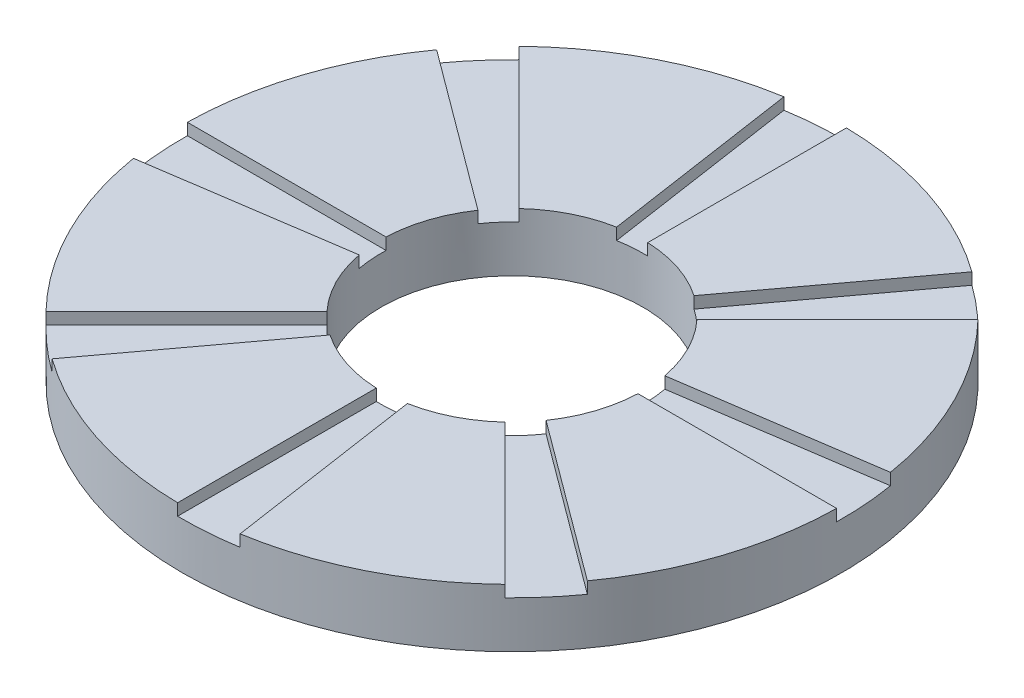
ISO-10303-21;
HEADER;
FILE_DESCRIPTION(('STEP AP214'),'2;1');
FILE_NAME('part.step','',(''),(''),'','','');
FILE_SCHEMA(('AUTOMOTIVE_DESIGN { 1 0 10303 214 1 1 1 1 }'));
ENDSEC;
DATA;
#1=APPLICATION_CONTEXT('core data for automotive mechanical design processes');
#2=APPLICATION_PROTOCOL_DEFINITION('international standard','automotive_design',2000,#1);
#3=PRODUCT_CONTEXT('',#1,'mechanical');
#4=PRODUCT('Part','Part','',(#3));
#5=PRODUCT_RELATED_PRODUCT_CATEGORY('part','',(#4));
#6=PRODUCT_DEFINITION_FORMATION('','',#4);
#7=PRODUCT_DEFINITION_CONTEXT('part definition',#1,'design');
#8=PRODUCT_DEFINITION('design','',#6,#7);
#9=PRODUCT_DEFINITION_SHAPE('','',#8);
#10=(LENGTH_UNIT() NAMED_UNIT(*) SI_UNIT(.MILLI.,.METRE.));
#11=(NAMED_UNIT(*) PLANE_ANGLE_UNIT() SI_UNIT($,.RADIAN.));
#12=(NAMED_UNIT(*) SI_UNIT($,.STERADIAN.) SOLID_ANGLE_UNIT());
#13=UNCERTAINTY_MEASURE_WITH_UNIT(LENGTH_MEASURE(1.E-05),#10,'distance_accuracy_value','');
#14=(GEOMETRIC_REPRESENTATION_CONTEXT(3) GLOBAL_UNCERTAINTY_ASSIGNED_CONTEXT((#13)) GLOBAL_UNIT_ASSIGNED_CONTEXT((#10,
#11,#12)) REPRESENTATION_CONTEXT('',''));
#15=CARTESIAN_POINT('',(0.,0.,0.));
#16=DIRECTION('',(0.,0.,1.));
#17=DIRECTION('',(1.,0.,0.));
#18=AXIS2_PLACEMENT_3D('',#15,#16,#17);
#19=CARTESIAN_POINT('',(0.,10.,0.));
#20=DIRECTION('',(0.,1.,0.));
#21=DIRECTION('',(0.,0.,1.));
#22=AXIS2_PLACEMENT_3D('',#19,#20,#21);
#23=PLANE('',#22);
#24=CARTESIAN_POINT('',(0.,10.,0.));
#25=DIRECTION('',(0.,1.,0.));
#26=DIRECTION('',(0.,0.,1.));
#27=AXIS2_PLACEMENT_3D('',#24,#25,#26);
#28=CIRCLE('',#27,22.4405334719767);
#29=CARTESIAN_POINT('',(-12.679308810646,10.,18.5152010680732));
#30=VERTEX_POINT('',#29);
#31=CARTESIAN_POINT('',(-0.83764015496411,10.,22.4248946815296));
#32=VERTEX_POINT('',#31);
#33=EDGE_CURVE('E572',#30,#32,#28,.T.);
#34=ORIENTED_EDGE('',*,*,#33,.F.);
#35=DIRECTION('',(-0.59542218485859,0.,0.803412983326896));
#36=VECTOR('',#35,1.);
#37=CARTESIAN_POINT('',(0.672970975854119,10.,0.498749531194018));
#38=LINE('',#37,#36);
#39=CARTESIAN_POINT('',(-32.9564578938166,10.,45.8754930634804));
#40=VERTEX_POINT('',#39);
#41=EDGE_CURVE('E343',#30,#40,#38,.T.);
#42=ORIENTED_EDGE('',*,*,#41,.T.);
#43=CARTESIAN_POINT('',(0.,10.,0.));
#44=DIRECTION('',(0.,1.,0.));
#45=DIRECTION('',(0.,0.,1.));
#46=AXIS2_PLACEMENT_3D('',#43,#44,#45);
#47=CIRCLE('',#46,56.4861839809023);
#48=CARTESIAN_POINT('',(-0.83764015496411,10.,56.4799729080595));
#49=VERTEX_POINT('',#48);
#50=EDGE_CURVE('E623',#40,#49,#47,.T.);
#51=ORIENTED_EDGE('',*,*,#50,.T.);
#52=DIRECTION('',(0.,0.,1.));
#53=VECTOR('',#52,1.);
#54=CARTESIAN_POINT('',(-0.83764015496411,10.,0.));
#55=LINE('',#54,#53);
#56=EDGE_CURVE('E325',#32,#49,#55,.T.);
#57=ORIENTED_EDGE('',*,*,#56,.F.);
#58=EDGE_LOOP('',(#34,#42,#51,#57));
#59=FACE_BOUND('',#58,.T.);
#60=ADVANCED_FACE('F41',(#59),#23,.T.);
#61=CARTESIAN_POINT('',(4.12659898950101,10.,22.0578494710331));
#62=VERTEX_POINT('',#61);
#63=CARTESIAN_POINT('',(15.2644940629344,10.,16.4490961304731));
#64=VERTEX_POINT('',#63);
#65=EDGE_CURVE('E577',#62,#64,#28,.T.);
#66=ORIENTED_EDGE('',*,*,#65,.F.);
#67=DIRECTION('',(0.147071704021353,0.,0.989125833186181));
#68=VECTOR('',#67,1.);
#69=CARTESIAN_POINT('',(0.828531516189076,10.,-0.123193164947281));
#70=LINE('',#69,#68);
#71=CARTESIAN_POINT('',(9.13513737485721,10.,55.74260709607));
#72=VERTEX_POINT('',#71);
#73=EDGE_CURVE('E319',#62,#72,#70,.T.);
#74=ORIENTED_EDGE('',*,*,#73,.T.);
#75=CARTESIAN_POINT('',(39.3450708107519,10.,40.5296728782908));
#76=VERTEX_POINT('',#75);
#77=EDGE_CURVE('E617',#72,#76,#47,.T.);
#78=ORIENTED_EDGE('',*,*,#77,.T.);
#79=DIRECTION('',(0.707106781186544,0.,0.707106781186551));
#80=VECTOR('',#79,1.);
#81=CARTESIAN_POINT('',(-0.592301033769276,10.,0.592301033769269));
#82=LINE('',#81,#80);
#83=EDGE_CURVE('E335',#64,#76,#82,.T.);
#84=ORIENTED_EDGE('',*,*,#83,.F.);
#85=EDGE_LOOP('',(#66,#74,#78,#84));
#86=FACE_BOUND('',#85,.T.);
#87=ADVANCED_FACE('F675',(#86),#23,.T.);
#88=CARTESIAN_POINT('',(18.5152010680732,10.,12.679308810646));
#89=VERTEX_POINT('',#88);
#90=CARTESIAN_POINT('',(22.4248946815296,10.,0.837640154964188));
#91=VERTEX_POINT('',#90);
#92=EDGE_CURVE('E582',#89,#91,#28,.T.);
#93=ORIENTED_EDGE('',*,*,#92,.F.);
#94=DIRECTION('',(0.803412983326898,0.,0.595422184858587));
#95=VECTOR('',#94,1.);
#96=CARTESIAN_POINT('',(0.498749531194016,10.,-0.672970975854121));
#97=LINE('',#96,#95);
#98=CARTESIAN_POINT('',(45.8754930634805,10.,32.9564578938165));
#99=VERTEX_POINT('',#98);
#100=EDGE_CURVE('E389',#89,#99,#97,.T.);
#101=ORIENTED_EDGE('',*,*,#100,.T.);
#102=CARTESIAN_POINT('',(56.4799729080595,10.,0.837640154964307));
#103=VERTEX_POINT('',#102);
#104=EDGE_CURVE('E611',#99,#103,#47,.T.);
#105=ORIENTED_EDGE('',*,*,#104,.T.);
#106=DIRECTION('',(1.,0.,0.));
#107=VECTOR('',#106,1.);
#108=CARTESIAN_POINT('',(0.,10.,0.83764015496411));
#109=LINE('',#108,#107);
#110=EDGE_CURVE('E371',#91,#103,#109,.T.);
#111=ORIENTED_EDGE('',*,*,#110,.F.);
#112=EDGE_LOOP('',(#93,#101,#105,#111));
#113=FACE_BOUND('',#112,.T.);
#114=ADVANCED_FACE('F680',(#113),#23,.T.);
#115=CARTESIAN_POINT('',(22.0578494710331,10.,-4.12659898950093));
#116=VERTEX_POINT('',#115);
#117=CARTESIAN_POINT('',(16.4490961304731,10.,-15.2644940629345));
#118=VERTEX_POINT('',#117);
#119=EDGE_CURVE('E587',#116,#118,#28,.T.);
#120=ORIENTED_EDGE('',*,*,#119,.F.);
#121=DIRECTION('',(0.989125833186181,0.,-0.147071704021349));
#122=VECTOR('',#121,1.);
#123=CARTESIAN_POINT('',(-0.123193164947278,10.,-0.828531516189077));
#124=LINE('',#123,#122);
#125=CARTESIAN_POINT('',(55.74260709607,10.,-9.13513737485702));
#126=VERTEX_POINT('',#125);
#127=EDGE_CURVE('E363',#116,#126,#124,.T.);
#128=ORIENTED_EDGE('',*,*,#127,.T.);
#129=CARTESIAN_POINT('',(40.5296728782907,10.,-39.345070810752));
#130=VERTEX_POINT('',#129);
#131=EDGE_CURVE('E608',#126,#130,#47,.T.);
#132=ORIENTED_EDGE('',*,*,#131,.T.);
#133=DIRECTION('',(0.707106781186549,0.,-0.707106781186546));
#134=VECTOR('',#133,1.);
#135=CARTESIAN_POINT('',(0.592301033769271,10.,0.592301033769273));
#136=LINE('',#135,#134);
#137=EDGE_CURVE('E381',#118,#130,#136,.T.);
#138=ORIENTED_EDGE('',*,*,#137,.F.);
#139=EDGE_LOOP('',(#120,#128,#132,#138));
#140=FACE_BOUND('',#139,.T.);
#141=ADVANCED_FACE('F699',(#140),#23,.T.);
#142=DIRECTION('',(-0.707106781186554,0.,0.707106781186541));
#143=VECTOR('',#142,1.);
#144=CARTESIAN_POINT('',(-0.592301033769267,10.,-0.592301033769278));
#145=LINE('',#144,#143);
#146=CARTESIAN_POINT('',(-16.4490961304732,10.,15.2644940629343));
#147=VERTEX_POINT('',#146);
#148=CARTESIAN_POINT('',(-40.529672878291,10.,39.3450708107517));
#149=VERTEX_POINT('',#148);
#150=EDGE_CURVE('E290',#147,#149,#145,.T.);
#151=ORIENTED_EDGE('',*,*,#150,.F.);
#152=CARTESIAN_POINT('',(-22.0578494710331,10.,4.12659898950078));
#153=VERTEX_POINT('',#152);
#154=EDGE_CURVE('E567',#153,#147,#28,.T.);
#155=ORIENTED_EDGE('',*,*,#154,.F.);
#156=DIRECTION('',(-0.989125833186182,0.,0.147071704021342));
#157=VECTOR('',#156,1.);
#158=CARTESIAN_POINT('',(0.123193164947273,10.,0.828531516189078));
#159=LINE('',#158,#157);
#160=CARTESIAN_POINT('',(-55.7426070960701,10.,9.13513737485663));
#161=VERTEX_POINT('',#160);
#162=EDGE_CURVE('E262',#153,#161,#159,.T.);
#163=ORIENTED_EDGE('',*,*,#162,.T.);
#164=EDGE_CURVE('E568',#161,#149,#47,.T.);
#165=ORIENTED_EDGE('',*,*,#164,.T.);
#166=EDGE_LOOP('',(#151,#155,#163,#165));
#167=FACE_BOUND('',#166,.T.);
#168=ADVANCED_FACE('F566',(#167),#23,.T.);
#169=DIRECTION('',(-1.,0.,0.));
#170=VECTOR('',#169,1.);
#171=CARTESIAN_POINT('',(0.,10.,-0.83764015496411));
#172=LINE('',#171,#170);
#173=CARTESIAN_POINT('',(-22.4248946815296,10.,-0.837640154964345));
#174=VERTEX_POINT('',#173);
#175=CARTESIAN_POINT('',(-56.4799729080595,10.,-0.837640154964701));
#176=VERTEX_POINT('',#175);
#177=EDGE_CURVE('E268',#174,#176,#172,.T.);
#178=ORIENTED_EDGE('',*,*,#177,.F.);
#179=CARTESIAN_POINT('',(-18.5152010680732,10.,-12.6793088106461));
#180=VERTEX_POINT('',#179);
#181=EDGE_CURVE('E461',#180,#174,#28,.T.);
#182=ORIENTED_EDGE('',*,*,#181,.F.);
#183=DIRECTION('',(-0.803412983326894,0.,-0.595422184858593));
#184=VECTOR('',#183,1.);
#185=CARTESIAN_POINT('',(-0.49874953119402,10.,0.672970975854117));
#186=LINE('',#185,#184);
#187=CARTESIAN_POINT('',(-45.8754930634802,10.,-32.9564578938168));
#188=VERTEX_POINT('',#187);
#189=EDGE_CURVE('E296',#180,#188,#186,.T.);
#190=ORIENTED_EDGE('',*,*,#189,.T.);
#191=EDGE_CURVE('E471',#188,#176,#47,.T.);
#192=ORIENTED_EDGE('',*,*,#191,.T.);
#193=EDGE_LOOP('',(#178,#182,#190,#192));
#194=FACE_BOUND('',#193,.T.);
#195=ADVANCED_FACE('F635',(#194),#23,.T.);
#196=CARTESIAN_POINT('',(12.6793088106459,10.,-18.5152010680733));
#197=VERTEX_POINT('',#196);
#198=CARTESIAN_POINT('',(0.83764015496411,10.,-22.4248946815296));
#199=VERTEX_POINT('',#198);
#200=EDGE_CURVE('E462',#197,#199,#28,.T.);
#201=ORIENTED_EDGE('',*,*,#200,.F.);
#202=DIRECTION('',(0.595422184858584,0.,-0.8034129833269));
#203=VECTOR('',#202,1.);
#204=CARTESIAN_POINT('',(-0.672970975854122,10.,-0.498749531194013));
#205=LINE('',#204,#203);
#206=CARTESIAN_POINT('',(32.9564578938163,10.,-45.8754930634806));
#207=VERTEX_POINT('',#206);
#208=EDGE_CURVE('E411',#197,#207,#205,.T.);
#209=ORIENTED_EDGE('',*,*,#208,.T.);
#210=CARTESIAN_POINT('',(0.83764015496411,10.,-56.4799729080595));
#211=VERTEX_POINT('',#210);
#212=EDGE_CURVE('E472',#207,#211,#47,.T.);
#213=ORIENTED_EDGE('',*,*,#212,.T.);
#214=DIRECTION('',(0.,0.,-1.));
#215=VECTOR('',#214,1.);
#216=CARTESIAN_POINT('',(0.83764015496411,10.,0.));
#217=LINE('',#216,#215);
#218=EDGE_CURVE('E427',#199,#211,#217,.T.);
#219=ORIENTED_EDGE('',*,*,#218,.F.);
#220=EDGE_LOOP('',(#201,#209,#213,#219));
#221=FACE_BOUND('',#220,.T.);
#222=ADVANCED_FACE('F604',(#221),#23,.T.);
#223=CARTESIAN_POINT('',(0.,10.,0.));
#224=DIRECTION('',(0.,-1.,0.));
#225=DIRECTION('',(0.,0.,-1.));
#226=AXIS2_PLACEMENT_3D('',#223,#224,#225);
#227=CYLINDRICAL_SURFACE('',#226,56.4861839809023);
#228=CARTESIAN_POINT('',(0.,0.,0.));
#229=DIRECTION('',(0.,1.,0.));
#230=DIRECTION('',(0.,0.,1.));
#231=AXIS2_PLACEMENT_3D('',#228,#229,#230);
#232=CIRCLE('',#231,56.4861839809023);
#233=CARTESIAN_POINT('',(0.,0.,56.4861839809023));
#234=VERTEX_POINT('',#233);
#235=EDGE_CURVE('E460',#234,#234,#232,.T.);
#236=ORIENTED_EDGE('',*,*,#235,.T.);
#237=EDGE_LOOP('',(#236));
#238=FACE_BOUND('',#237,.T.);
#239=DIRECTION('',(0.,1.,0.));
#240=VECTOR('',#239,1.);
#241=CARTESIAN_POINT('',(-32.9564578938166,8.,45.8754930634804));
#242=LINE('',#241,#240);
#243=CARTESIAN_POINT('',(-32.9564578938166,8.,45.8754930634804));
#244=VERTEX_POINT('',#243);
#245=EDGE_CURVE('E328',#244,#40,#242,.T.);
#246=ORIENTED_EDGE('',*,*,#245,.F.);
#247=CARTESIAN_POINT('',(0.,8.,0.));
#248=DIRECTION('',(0.,1.,0.));
#249=DIRECTION('',(0.707106781186554,0.,-0.707106781186541));
#250=AXIS2_PLACEMENT_3D('',#247,#248,#249);
#251=CIRCLE('',#250,56.4861839809023);
#252=CARTESIAN_POINT('',(-40.529672878291,8.,39.3450708107517));
#253=VERTEX_POINT('',#252);
#254=EDGE_CURVE('E342',#253,#244,#251,.T.);
#255=ORIENTED_EDGE('',*,*,#254,.F.);
#256=DIRECTION('',(0.,1.,0.));
#257=VECTOR('',#256,1.);
#258=CARTESIAN_POINT('',(-40.529672878291,8.,39.3450708107517));
#259=LINE('',#258,#257);
#260=EDGE_CURVE('E348',#253,#149,#259,.T.);
#261=ORIENTED_EDGE('',*,*,#260,.T.);
#262=ORIENTED_EDGE('',*,*,#164,.F.);
#263=DIRECTION('',(0.,1.,0.));
#264=VECTOR('',#263,1.);
#265=CARTESIAN_POINT('',(-55.7426070960701,8.,9.13513737485663));
#266=LINE('',#265,#264);
#267=CARTESIAN_POINT('',(-55.7426070960701,8.,9.13513737485663));
#268=VERTEX_POINT('',#267);
#269=EDGE_CURVE('E273',#268,#161,#266,.T.);
#270=ORIENTED_EDGE('',*,*,#269,.F.);
#271=CARTESIAN_POINT('',(0.,8.,0.));
#272=DIRECTION('',(0.,1.,0.));
#273=DIRECTION('',(1.,0.,0.));
#274=AXIS2_PLACEMENT_3D('',#271,#272,#273);
#275=CIRCLE('',#274,56.4861839809023);
#276=CARTESIAN_POINT('',(-56.4799729080595,8.,-0.837640154964701));
#277=VERTEX_POINT('',#276);
#278=EDGE_CURVE('E255',#277,#268,#275,.T.);
#279=ORIENTED_EDGE('',*,*,#278,.F.);
#280=DIRECTION('',(0.,1.,0.));
#281=VECTOR('',#280,1.);
#282=CARTESIAN_POINT('',(-56.4799729080595,8.,-0.837640154964701));
#283=LINE('',#282,#281);
#284=EDGE_CURVE('E265',#277,#176,#283,.T.);
#285=ORIENTED_EDGE('',*,*,#284,.T.);
#286=ORIENTED_EDGE('',*,*,#191,.F.);
#287=DIRECTION('',(0.,1.,0.));
#288=VECTOR('',#287,1.);
#289=CARTESIAN_POINT('',(-45.8754930634802,8.,-32.9564578938168));
#290=LINE('',#289,#288);
#291=CARTESIAN_POINT('',(-45.8754930634802,8.,-32.9564578938168));
#292=VERTEX_POINT('',#291);
#293=EDGE_CURVE('E285',#292,#188,#290,.T.);
#294=ORIENTED_EDGE('',*,*,#293,.F.);
#295=CARTESIAN_POINT('',(0.,8.,0.));
#296=DIRECTION('',(0.,1.,0.));
#297=DIRECTION('',(0.707106781186539,0.,0.707106781186556));
#298=AXIS2_PLACEMENT_3D('',#295,#296,#297);
#299=CIRCLE('',#298,56.4861839809023);
#300=CARTESIAN_POINT('',(-39.3450708107516,8.,-40.5296728782911));
#301=VERTEX_POINT('',#300);
#302=EDGE_CURVE('E295',#301,#292,#299,.T.);
#303=ORIENTED_EDGE('',*,*,#302,.F.);
#304=DIRECTION('',(0.,1.,0.));
#305=VECTOR('',#304,1.);
#306=CARTESIAN_POINT('',(-39.3450708107516,8.,-40.5296728782911));
#307=LINE('',#306,#305);
#308=CARTESIAN_POINT('',(-39.3450708107516,10.,-40.5296728782911));
#309=VERTEX_POINT('',#308);
#310=EDGE_CURVE('E303',#301,#309,#307,.T.);
#311=ORIENTED_EDGE('',*,*,#310,.T.);
#312=CARTESIAN_POINT('',(-9.13513737485721,10.,-55.74260709607));
#313=VERTEX_POINT('',#312);
#314=EDGE_CURVE('E466',#313,#309,#47,.T.);
#315=ORIENTED_EDGE('',*,*,#314,.F.);
#316=DIRECTION('',(0.,1.,0.));
#317=VECTOR('',#316,1.);
#318=CARTESIAN_POINT('',(-9.13513737485721,8.,-55.74260709607));
#319=LINE('',#318,#317);
#320=CARTESIAN_POINT('',(-9.13513737485721,8.,-55.74260709607));
#321=VERTEX_POINT('',#320);
#322=EDGE_CURVE('E449',#321,#313,#319,.T.);
#323=ORIENTED_EDGE('',*,*,#322,.F.);
#324=CARTESIAN_POINT('',(0.,8.,0.));
#325=DIRECTION('',(0.,1.,0.));
#326=DIRECTION('',(0.,0.,1.));
#327=AXIS2_PLACEMENT_3D('',#324,#325,#326);
#328=CIRCLE('',#327,56.4861839809023);
#329=CARTESIAN_POINT('',(0.83764015496411,8.,-56.4799729080595));
#330=VERTEX_POINT('',#329);
#331=EDGE_CURVE('E434',#330,#321,#328,.T.);
#332=ORIENTED_EDGE('',*,*,#331,.F.);
#333=DIRECTION('',(0.,1.,0.));
#334=VECTOR('',#333,1.);
#335=CARTESIAN_POINT('',(0.83764015496411,8.,-56.4799729080595));
#336=LINE('',#335,#334);
#337=EDGE_CURVE('E442',#330,#211,#336,.T.);
#338=ORIENTED_EDGE('',*,*,#337,.T.);
#339=ORIENTED_EDGE('',*,*,#212,.F.);
#340=DIRECTION('',(0.,1.,0.));
#341=VECTOR('',#340,1.);
#342=CARTESIAN_POINT('',(32.9564578938163,8.,-45.8754930634806));
#343=LINE('',#342,#341);
#344=CARTESIAN_POINT('',(32.9564578938163,8.,-45.8754930634806));
#345=VERTEX_POINT('',#344);
#346=EDGE_CURVE('E424',#345,#207,#343,.T.);
#347=ORIENTED_EDGE('',*,*,#346,.F.);
#348=CARTESIAN_POINT('',(0.,8.,0.));
#349=DIRECTION('',(0.,1.,0.));
#350=DIRECTION('',(-0.707106781186549,0.,0.707106781186546));
#351=AXIS2_PLACEMENT_3D('',#348,#349,#350);
#352=CIRCLE('',#351,56.4861839809023);
#353=CARTESIAN_POINT('',(40.5296728782907,8.,-39.345070810752));
#354=VERTEX_POINT('',#353);
#355=EDGE_CURVE('E410',#354,#345,#352,.T.);
#356=ORIENTED_EDGE('',*,*,#355,.F.);
#357=DIRECTION('',(0.,1.,0.));
#358=VECTOR('',#357,1.);
#359=CARTESIAN_POINT('',(40.5296728782907,8.,-39.345070810752));
#360=LINE('',#359,#358);
#361=EDGE_CURVE('E418',#354,#130,#360,.T.);
#362=ORIENTED_EDGE('',*,*,#361,.T.);
#363=ORIENTED_EDGE('',*,*,#131,.F.);
#364=DIRECTION('',(0.,1.,0.));
#365=VECTOR('',#364,1.);
#366=CARTESIAN_POINT('',(55.74260709607,8.,-9.13513737485702));
#367=LINE('',#366,#365);
#368=CARTESIAN_POINT('',(55.74260709607,8.,-9.13513737485702));
#369=VERTEX_POINT('',#368);
#370=EDGE_CURVE('E378',#369,#126,#367,.T.);
#371=ORIENTED_EDGE('',*,*,#370,.F.);
#372=CARTESIAN_POINT('',(0.,8.,0.));
#373=DIRECTION('',(0.,1.,0.));
#374=DIRECTION('',(-1.,0.,0.));
#375=AXIS2_PLACEMENT_3D('',#372,#373,#374);
#376=CIRCLE('',#375,56.4861839809023);
#377=CARTESIAN_POINT('',(56.4799729080595,8.,0.837640154964307));
#378=VERTEX_POINT('',#377);
#379=EDGE_CURVE('E362',#378,#369,#376,.T.);
#380=ORIENTED_EDGE('',*,*,#379,.F.);
#381=DIRECTION('',(0.,1.,0.));
#382=VECTOR('',#381,1.);
#383=CARTESIAN_POINT('',(56.4799729080595,8.,0.837640154964307));
#384=LINE('',#383,#382);
#385=EDGE_CURVE('E370',#378,#103,#384,.T.);
#386=ORIENTED_EDGE('',*,*,#385,.T.);
#387=ORIENTED_EDGE('',*,*,#104,.F.);
#388=DIRECTION('',(0.,1.,0.));
#389=VECTOR('',#388,1.);
#390=CARTESIAN_POINT('',(45.8754930634805,8.,32.9564578938165));
#391=LINE('',#390,#389);
#392=CARTESIAN_POINT('',(45.8754930634805,8.,32.9564578938165));
#393=VERTEX_POINT('',#392);
#394=EDGE_CURVE('E374',#393,#99,#391,.T.);
#395=ORIENTED_EDGE('',*,*,#394,.F.);
#396=CARTESIAN_POINT('',(0.,8.,0.));
#397=DIRECTION('',(0.,1.,0.));
#398=DIRECTION('',(-0.707106781186544,0.,-0.707106781186551));
#399=AXIS2_PLACEMENT_3D('',#396,#397,#398);
#400=CIRCLE('',#399,56.4861839809023);
#401=CARTESIAN_POINT('',(39.3450708107519,8.,40.5296728782908));
#402=VERTEX_POINT('',#401);
#403=EDGE_CURVE('E388',#402,#393,#400,.T.);
#404=ORIENTED_EDGE('',*,*,#403,.F.);
#405=DIRECTION('',(0.,1.,0.));
#406=VECTOR('',#405,1.);
#407=CARTESIAN_POINT('',(39.3450708107519,8.,40.5296728782908));
#408=LINE('',#407,#406);
#409=EDGE_CURVE('E396',#402,#76,#408,.T.);
#410=ORIENTED_EDGE('',*,*,#409,.T.);
#411=ORIENTED_EDGE('',*,*,#77,.F.);
#412=DIRECTION('',(0.,1.,0.));
#413=VECTOR('',#412,1.);
#414=CARTESIAN_POINT('',(9.13513737485721,8.,55.74260709607));
#415=LINE('',#414,#413);
#416=CARTESIAN_POINT('',(9.13513737485721,8.,55.74260709607));
#417=VERTEX_POINT('',#416);
#418=EDGE_CURVE('E332',#417,#72,#415,.T.);
#419=ORIENTED_EDGE('',*,*,#418,.F.);
#420=CARTESIAN_POINT('',(0.,8.,0.));
#421=DIRECTION('',(0.,1.,0.));
#422=DIRECTION('',(0.,0.,-1.));
#423=AXIS2_PLACEMENT_3D('',#420,#421,#422);
#424=CIRCLE('',#423,56.4861839809023);
#425=CARTESIAN_POINT('',(-0.83764015496411,8.,56.4799729080595));
#426=VERTEX_POINT('',#425);
#427=EDGE_CURVE('E318',#426,#417,#424,.T.);
#428=ORIENTED_EDGE('',*,*,#427,.F.);
#429=DIRECTION('',(0.,1.,0.));
#430=VECTOR('',#429,1.);
#431=CARTESIAN_POINT('',(-0.83764015496411,8.,56.4799729080595));
#432=LINE('',#431,#430);
#433=EDGE_CURVE('E324',#426,#49,#432,.T.);
#434=ORIENTED_EDGE('',*,*,#433,.T.);
#435=ORIENTED_EDGE('',*,*,#50,.F.);
#436=EDGE_LOOP('',(#246,#255,#261,#262,#270,#279,#285,#286,#294,#303,#311,#315,#323,#332,#338,
#339,#347,#356,#362,#363,#371,#380,#386,#387,#395,#404,#410,#411,#419,#428,#434,#435));
#437=FACE_BOUND('',#436,.T.);
#438=ADVANCED_FACE('F43',(#238,#437),#227,.T.);
#439=CARTESIAN_POINT('',(0.,10.,0.));
#440=DIRECTION('',(0.,-1.,0.));
#441=DIRECTION('',(0.,0.,-1.));
#442=AXIS2_PLACEMENT_3D('',#439,#440,#441);
#443=CYLINDRICAL_SURFACE('',#442,22.4405334719767);
#444=CARTESIAN_POINT('',(0.,0.,0.));
#445=DIRECTION('',(0.,1.,0.));
#446=DIRECTION('',(0.,0.,1.));
#447=AXIS2_PLACEMENT_3D('',#444,#445,#446);
#448=CIRCLE('',#447,22.4405334719767);
#449=CARTESIAN_POINT('',(0.,0.,22.4405334719767));
#450=VERTEX_POINT('',#449);
#451=EDGE_CURVE('E452',#450,#450,#448,.T.);
#452=ORIENTED_EDGE('',*,*,#451,.F.);
#453=EDGE_LOOP('',(#452));
#454=FACE_BOUND('',#453,.T.);
#455=CARTESIAN_POINT('',(0.,8.,0.));
#456=DIRECTION('',(0.,1.,0.));
#457=DIRECTION('',(0.,0.,1.));
#458=AXIS2_PLACEMENT_3D('',#455,#456,#457);
#459=CIRCLE('',#458,22.4405334719767);
#460=CARTESIAN_POINT('',(-16.4490961304732,8.,15.2644940629343));
#461=VERTEX_POINT('',#460);
#462=CARTESIAN_POINT('',(-12.679308810646,8.,18.5152010680732));
#463=VERTEX_POINT('',#462);
#464=EDGE_CURVE('E551',#461,#463,#459,.T.);
#465=ORIENTED_EDGE('',*,*,#464,.T.);
#466=DIRECTION('',(0.,-1.,0.));
#467=VECTOR('',#466,1.);
#468=CARTESIAN_POINT('',(-12.679308810646,10.,18.5152010680732));
#469=LINE('',#468,#467);
#470=EDGE_CURVE('E11',#463,#30,#469,.F.);
#471=ORIENTED_EDGE('',*,*,#470,.T.);
#472=ORIENTED_EDGE('',*,*,#33,.T.);
#473=DIRECTION('',(0.,-1.,0.));
#474=VECTOR('',#473,1.);
#475=CARTESIAN_POINT('',(-0.83764015496411,10.,22.4248946815296));
#476=LINE('',#475,#474);
#477=CARTESIAN_POINT('',(-0.83764015496411,8.,22.4248946815296));
#478=VERTEX_POINT('',#477);
#479=EDGE_CURVE('E544',#478,#32,#476,.F.);
#480=ORIENTED_EDGE('',*,*,#479,.F.);
#481=CARTESIAN_POINT('',(0.,8.,0.));
#482=DIRECTION('',(0.,1.,0.));
#483=DIRECTION('',(0.,0.,1.));
#484=AXIS2_PLACEMENT_3D('',#481,#482,#483);
#485=CIRCLE('',#484,22.4405334719767);
#486=CARTESIAN_POINT('',(4.12659898950101,8.,22.0578494710331));
#487=VERTEX_POINT('',#486);
#488=EDGE_CURVE('E540',#478,#487,#485,.T.);
#489=ORIENTED_EDGE('',*,*,#488,.T.);
#490=DIRECTION('',(0.,-1.,0.));
#491=VECTOR('',#490,1.);
#492=CARTESIAN_POINT('',(4.12659898950101,10.,22.0578494710331));
#493=LINE('',#492,#491);
#494=EDGE_CURVE('E547',#487,#62,#493,.F.);
#495=ORIENTED_EDGE('',*,*,#494,.T.);
#496=ORIENTED_EDGE('',*,*,#65,.T.);
#497=DIRECTION('',(0.,-1.,0.));
#498=VECTOR('',#497,1.);
#499=CARTESIAN_POINT('',(15.2644940629344,10.,16.4490961304731));
#500=LINE('',#499,#498);
#501=CARTESIAN_POINT('',(15.2644940629344,8.,16.4490961304731));
#502=VERTEX_POINT('',#501);
#503=EDGE_CURVE('E533',#502,#64,#500,.F.);
#504=ORIENTED_EDGE('',*,*,#503,.F.);
#505=CARTESIAN_POINT('',(0.,8.,0.));
#506=DIRECTION('',(0.,1.,0.));
#507=DIRECTION('',(0.,0.,1.));
#508=AXIS2_PLACEMENT_3D('',#505,#506,#507);
#509=CIRCLE('',#508,22.4405334719767);
#510=CARTESIAN_POINT('',(18.5152010680732,8.,12.679308810646));
#511=VERTEX_POINT('',#510);
#512=EDGE_CURVE('E529',#502,#511,#509,.T.);
#513=ORIENTED_EDGE('',*,*,#512,.T.);
#514=DIRECTION('',(0.,-1.,0.));
#515=VECTOR('',#514,1.);
#516=CARTESIAN_POINT('',(18.5152010680732,10.,12.679308810646));
#517=LINE('',#516,#515);
#518=EDGE_CURVE('E536',#511,#89,#517,.F.);
#519=ORIENTED_EDGE('',*,*,#518,.T.);
#520=ORIENTED_EDGE('',*,*,#92,.T.);
#521=DIRECTION('',(0.,-1.,0.));
#522=VECTOR('',#521,1.);
#523=CARTESIAN_POINT('',(22.4248946815296,10.,0.837640154964188));
#524=LINE('',#523,#522);
#525=CARTESIAN_POINT('',(22.4248946815296,8.,0.837640154964188));
#526=VERTEX_POINT('',#525);
#527=EDGE_CURVE('E522',#526,#91,#524,.F.);
#528=ORIENTED_EDGE('',*,*,#527,.F.);
#529=CARTESIAN_POINT('',(0.,8.,0.));
#530=DIRECTION('',(0.,1.,0.));
#531=DIRECTION('',(0.,0.,1.));
#532=AXIS2_PLACEMENT_3D('',#529,#530,#531);
#533=CIRCLE('',#532,22.4405334719767);
#534=CARTESIAN_POINT('',(22.0578494710331,8.,-4.12659898950093));
#535=VERTEX_POINT('',#534);
#536=EDGE_CURVE('E518',#526,#535,#533,.T.);
#537=ORIENTED_EDGE('',*,*,#536,.T.);
#538=DIRECTION('',(0.,-1.,0.));
#539=VECTOR('',#538,1.);
#540=CARTESIAN_POINT('',(22.0578494710331,10.,-4.12659898950093));
#541=LINE('',#540,#539);
#542=EDGE_CURVE('E525',#535,#116,#541,.F.);
#543=ORIENTED_EDGE('',*,*,#542,.T.);
#544=ORIENTED_EDGE('',*,*,#119,.T.);
#545=DIRECTION('',(0.,-1.,0.));
#546=VECTOR('',#545,1.);
#547=CARTESIAN_POINT('',(16.4490961304731,10.,-15.2644940629345));
#548=LINE('',#547,#546);
#549=CARTESIAN_POINT('',(16.4490961304731,8.,-15.2644940629345));
#550=VERTEX_POINT('',#549);
#551=EDGE_CURVE('E491',#550,#118,#548,.F.);
#552=ORIENTED_EDGE('',*,*,#551,.F.);
#553=CARTESIAN_POINT('',(0.,8.,0.));
#554=DIRECTION('',(0.,1.,0.));
#555=DIRECTION('',(0.,0.,1.));
#556=AXIS2_PLACEMENT_3D('',#553,#554,#555);
#557=CIRCLE('',#556,22.4405334719767);
#558=CARTESIAN_POINT('',(12.6793088106459,8.,-18.5152010680733));
#559=VERTEX_POINT('',#558);
#560=EDGE_CURVE('E487',#550,#559,#557,.T.);
#561=ORIENTED_EDGE('',*,*,#560,.T.);
#562=DIRECTION('',(0.,-1.,0.));
#563=VECTOR('',#562,1.);
#564=CARTESIAN_POINT('',(12.6793088106459,10.,-18.5152010680733));
#565=LINE('',#564,#563);
#566=EDGE_CURVE('E494',#559,#197,#565,.F.);
#567=ORIENTED_EDGE('',*,*,#566,.T.);
#568=ORIENTED_EDGE('',*,*,#200,.T.);
#569=DIRECTION('',(0.,-1.,0.));
#570=VECTOR('',#569,1.);
#571=CARTESIAN_POINT('',(0.83764015496411,10.,-22.4248946815296));
#572=LINE('',#571,#570);
#573=CARTESIAN_POINT('',(0.83764015496411,8.,-22.4248946815296));
#574=VERTEX_POINT('',#573);
#575=EDGE_CURVE('E479',#574,#199,#572,.F.);
#576=ORIENTED_EDGE('',*,*,#575,.F.);
#577=CARTESIAN_POINT('',(0.,8.,0.));
#578=DIRECTION('',(0.,1.,0.));
#579=DIRECTION('',(0.,0.,1.));
#580=AXIS2_PLACEMENT_3D('',#577,#578,#579);
#581=CIRCLE('',#580,22.4405334719767);
#582=CARTESIAN_POINT('',(-4.12659898950101,8.,-22.0578494710331));
#583=VERTEX_POINT('',#582);
#584=EDGE_CURVE('E470',#574,#583,#581,.T.);
#585=ORIENTED_EDGE('',*,*,#584,.T.);
#586=DIRECTION('',(0.,-1.,0.));
#587=VECTOR('',#586,1.);
#588=CARTESIAN_POINT('',(-4.12659898950101,10.,-22.0578494710331));
#589=LINE('',#588,#587);
#590=CARTESIAN_POINT('',(-4.12659898950101,10.,-22.0578494710331));
#591=VERTEX_POINT('',#590);
#592=EDGE_CURVE('E483',#583,#591,#589,.F.);
#593=ORIENTED_EDGE('',*,*,#592,.T.);
#594=CARTESIAN_POINT('',(-15.2644940629343,10.,-16.4490961304732));
#595=VERTEX_POINT('',#594);
#596=EDGE_CURVE('E456',#591,#595,#28,.T.);
#597=ORIENTED_EDGE('',*,*,#596,.T.);
#598=DIRECTION('',(0.,-1.,0.));
#599=VECTOR('',#598,1.);
#600=CARTESIAN_POINT('',(-15.2644940629343,10.,-16.4490961304732));
#601=LINE('',#600,#599);
#602=CARTESIAN_POINT('',(-15.2644940629343,8.,-16.4490961304732));
#603=VERTEX_POINT('',#602);
#604=EDGE_CURVE('E502',#603,#595,#601,.F.);
#605=ORIENTED_EDGE('',*,*,#604,.F.);
#606=CARTESIAN_POINT('',(0.,8.,0.));
#607=DIRECTION('',(0.,1.,0.));
#608=DIRECTION('',(0.,0.,1.));
#609=AXIS2_PLACEMENT_3D('',#606,#607,#608);
#610=CIRCLE('',#609,22.4405334719767);
#611=CARTESIAN_POINT('',(-18.5152010680732,8.,-12.6793088106461));
#612=VERTEX_POINT('',#611);
#613=EDGE_CURVE('E498',#603,#612,#610,.T.);
#614=ORIENTED_EDGE('',*,*,#613,.T.);
#615=DIRECTION('',(0.,-1.,0.));
#616=VECTOR('',#615,1.);
#617=CARTESIAN_POINT('',(-18.5152010680731,10.,-12.6793088106461));
#618=LINE('',#617,#616);
#619=EDGE_CURVE('E505',#612,#180,#618,.F.);
#620=ORIENTED_EDGE('',*,*,#619,.T.);
#621=ORIENTED_EDGE('',*,*,#181,.T.);
#622=DIRECTION('',(0.,-1.,0.));
#623=VECTOR('',#622,1.);
#624=CARTESIAN_POINT('',(-22.4248946815296,10.,-0.837640154964345));
#625=LINE('',#624,#623);
#626=CARTESIAN_POINT('',(-22.4248946815296,8.,-0.837640154964345));
#627=VERTEX_POINT('',#626);
#628=EDGE_CURVE('E511',#627,#174,#625,.F.);
#629=ORIENTED_EDGE('',*,*,#628,.F.);
#630=CARTESIAN_POINT('',(0.,8.,0.));
#631=DIRECTION('',(0.,1.,0.));
#632=DIRECTION('',(0.,0.,1.));
#633=AXIS2_PLACEMENT_3D('',#630,#631,#632);
#634=CIRCLE('',#633,22.4405334719767);
#635=CARTESIAN_POINT('',(-22.0578494710331,8.,4.12659898950078));
#636=VERTEX_POINT('',#635);
#637=EDGE_CURVE('E258',#627,#636,#634,.T.);
#638=ORIENTED_EDGE('',*,*,#637,.T.);
#639=DIRECTION('',(0.,-1.,0.));
#640=VECTOR('',#639,1.);
#641=CARTESIAN_POINT('',(-22.0578494710331,10.,4.12659898950078));
#642=LINE('',#641,#640);
#643=EDGE_CURVE('E514',#636,#153,#642,.F.);
#644=ORIENTED_EDGE('',*,*,#643,.T.);
#645=ORIENTED_EDGE('',*,*,#154,.T.);
#646=DIRECTION('',(0.,-1.,0.));
#647=VECTOR('',#646,1.);
#648=CARTESIAN_POINT('',(-16.4490961304732,10.,15.2644940629343));
#649=LINE('',#648,#647);
#650=EDGE_CURVE('E50',#461,#147,#649,.F.);
#651=ORIENTED_EDGE('',*,*,#650,.F.);
#652=EDGE_LOOP('',(#465,#471,#472,#480,#489,#495,#496,#504,#513,#519,#520,#528,#537,#543,#544,
#552,#561,#567,#568,#576,#585,#593,#597,#605,#614,#620,#621,#629,#638,#644,#645,#651));
#653=FACE_BOUND('',#652,.T.);
#654=ADVANCED_FACE('F569',(#454,#653),#443,.F.);
#655=DIRECTION('',(-0.707106781186539,0.,-0.707106781186556));
#656=VECTOR('',#655,1.);
#657=CARTESIAN_POINT('',(0.59230103376928,10.,-0.592301033769265));
#658=LINE('',#657,#656);
#659=EDGE_CURVE('E304',#595,#309,#658,.T.);
#660=ORIENTED_EDGE('',*,*,#659,.F.);
#661=ORIENTED_EDGE('',*,*,#596,.F.);
#662=DIRECTION('',(-0.147071704021353,0.,-0.989125833186181));
#663=VECTOR('',#662,1.);
#664=CARTESIAN_POINT('',(-0.828531516189076,10.,0.123193164947281));
#665=LINE('',#664,#663);
#666=EDGE_CURVE('E435',#591,#313,#665,.T.);
#667=ORIENTED_EDGE('',*,*,#666,.T.);
#668=ORIENTED_EDGE('',*,*,#314,.T.);
#669=EDGE_LOOP('',(#660,#661,#667,#668));
#670=FACE_BOUND('',#669,.T.);
#671=ADVANCED_FACE('F653',(#670),#23,.T.);
#672=CARTESIAN_POINT('',(0.,0.,0.));
#673=DIRECTION('',(0.,1.,0.));
#674=DIRECTION('',(0.,0.,1.));
#675=AXIS2_PLACEMENT_3D('',#672,#673,#674);
#676=PLANE('',#675);
#677=ORIENTED_EDGE('',*,*,#235,.F.);
#678=EDGE_LOOP('',(#677));
#679=FACE_BOUND('',#678,.T.);
#680=ORIENTED_EDGE('',*,*,#451,.T.);
#681=EDGE_LOOP('',(#680));
#682=FACE_BOUND('',#681,.T.);
#683=ADVANCED_FACE('F683',(#679,#682),#676,.F.);
#684=CARTESIAN_POINT('',(-0.828531516189076,8.,0.123193164947281));
#685=DIRECTION('',(0.98912583318618,0.,-0.147071704021353));
#686=DIRECTION('',(-0.147071704021353,0.,-0.989125833186181));
#687=AXIS2_PLACEMENT_3D('',#684,#685,#686);
#688=PLANE('',#687);
#689=DIRECTION('',(-0.147071704021353,0.,-0.989125833186181));
#690=VECTOR('',#689,1.);
#691=CARTESIAN_POINT('',(-0.828531516189076,8.,0.123193164947281));
#692=LINE('',#691,#690);
#693=EDGE_CURVE('E439',#583,#321,#692,.T.);
#694=ORIENTED_EDGE('',*,*,#693,.T.);
#695=ORIENTED_EDGE('',*,*,#322,.T.);
#696=ORIENTED_EDGE('',*,*,#666,.F.);
#697=ORIENTED_EDGE('',*,*,#592,.F.);
#698=EDGE_LOOP('',(#694,#695,#696,#697));
#699=FACE_BOUND('',#698,.T.);
#700=ADVANCED_FACE('F657',(#699),#688,.T.);
#701=CARTESIAN_POINT('',(0.83764015496411,8.,0.));
#702=DIRECTION('',(1.,0.,0.));
#703=DIRECTION('',(0.,0.,-1.));
#704=AXIS2_PLACEMENT_3D('',#701,#702,#703);
#705=PLANE('',#704);
#706=ORIENTED_EDGE('',*,*,#575,.T.);
#707=ORIENTED_EDGE('',*,*,#218,.T.);
#708=ORIENTED_EDGE('',*,*,#337,.F.);
#709=DIRECTION('',(0.,0.,-1.));
#710=VECTOR('',#709,1.);
#711=CARTESIAN_POINT('',(0.83764015496411,8.,0.));
#712=LINE('',#711,#710);
#713=EDGE_CURVE('E431',#574,#330,#712,.T.);
#714=ORIENTED_EDGE('',*,*,#713,.F.);
#715=EDGE_LOOP('',(#706,#707,#708,#714));
#716=FACE_BOUND('',#715,.T.);
#717=ADVANCED_FACE('F602',(#716),#705,.F.);
#718=CARTESIAN_POINT('',(0.,8.,0.));
#719=DIRECTION('',(0.,1.,0.));
#720=DIRECTION('',(0.,0.,1.));
#721=AXIS2_PLACEMENT_3D('',#718,#719,#720);
#722=PLANE('',#721);
#723=ORIENTED_EDGE('',*,*,#713,.T.);
#724=ORIENTED_EDGE('',*,*,#331,.T.);
#725=ORIENTED_EDGE('',*,*,#693,.F.);
#726=ORIENTED_EDGE('',*,*,#584,.F.);
#727=EDGE_LOOP('',(#723,#724,#725,#726));
#728=FACE_BOUND('',#727,.T.);
#729=ADVANCED_FACE('F659',(#728),#722,.T.);
#730=CARTESIAN_POINT('',(-0.672970975854122,8.,-0.498749531194013));
#731=DIRECTION('',(0.8034129833269,0.,0.595422184858584));
#732=DIRECTION('',(0.595422184858584,0.,-0.8034129833269));
#733=AXIS2_PLACEMENT_3D('',#730,#731,#732);
#734=PLANE('',#733);
#735=DIRECTION('',(0.595422184858584,0.,-0.8034129833269));
#736=VECTOR('',#735,1.);
#737=CARTESIAN_POINT('',(-0.672970975854122,8.,-0.498749531194013));
#738=LINE('',#737,#736);
#739=EDGE_CURVE('E415',#559,#345,#738,.T.);
#740=ORIENTED_EDGE('',*,*,#739,.T.);
#741=ORIENTED_EDGE('',*,*,#346,.T.);
#742=ORIENTED_EDGE('',*,*,#208,.F.);
#743=ORIENTED_EDGE('',*,*,#566,.F.);
#744=EDGE_LOOP('',(#740,#741,#742,#743));
#745=FACE_BOUND('',#744,.T.);
#746=ADVANCED_FACE('F662',(#745),#734,.T.);
#747=CARTESIAN_POINT('',(0.592301033769271,8.,0.592301033769273));
#748=DIRECTION('',(0.707106781186546,0.,0.707106781186549));
#749=DIRECTION('',(0.707106781186549,0.,-0.707106781186546));
#750=AXIS2_PLACEMENT_3D('',#747,#748,#749);
#751=PLANE('',#750);
#752=ORIENTED_EDGE('',*,*,#551,.T.);
#753=ORIENTED_EDGE('',*,*,#137,.T.);
#754=ORIENTED_EDGE('',*,*,#361,.F.);
#755=DIRECTION('',(0.707106781186549,0.,-0.707106781186546));
#756=VECTOR('',#755,1.);
#757=CARTESIAN_POINT('',(0.592301033769271,8.,0.592301033769273));
#758=LINE('',#757,#756);
#759=EDGE_CURVE('E407',#550,#354,#758,.T.);
#760=ORIENTED_EDGE('',*,*,#759,.F.);
#761=EDGE_LOOP('',(#752,#753,#754,#760));
#762=FACE_BOUND('',#761,.T.);
#763=ADVANCED_FACE('F668',(#762),#751,.F.);
#764=CARTESIAN_POINT('',(0.,8.,0.));
#765=DIRECTION('',(0.,1.,0.));
#766=DIRECTION('',(-0.707106781186549,0.,0.707106781186546));
#767=AXIS2_PLACEMENT_3D('',#764,#765,#766);
#768=PLANE('',#767);
#769=ORIENTED_EDGE('',*,*,#759,.T.);
#770=ORIENTED_EDGE('',*,*,#355,.T.);
#771=ORIENTED_EDGE('',*,*,#739,.F.);
#772=ORIENTED_EDGE('',*,*,#560,.F.);
#773=EDGE_LOOP('',(#769,#770,#771,#772));
#774=FACE_BOUND('',#773,.T.);
#775=ADVANCED_FACE('F712',(#774),#768,.T.);
#776=CARTESIAN_POINT('',(-0.49874953119402,8.,0.672970975854117));
#777=DIRECTION('',(0.595422184858593,0.,-0.803412983326894));
#778=DIRECTION('',(-0.803412983326894,0.,-0.595422184858593));
#779=AXIS2_PLACEMENT_3D('',#776,#777,#778);
#780=PLANE('',#779);
#781=DIRECTION('',(-0.803412983326894,0.,-0.595422184858593));
#782=VECTOR('',#781,1.);
#783=CARTESIAN_POINT('',(-0.49874953119402,8.,0.672970975854117));
#784=LINE('',#783,#782);
#785=EDGE_CURVE('E300',#612,#292,#784,.T.);
#786=ORIENTED_EDGE('',*,*,#785,.T.);
#787=ORIENTED_EDGE('',*,*,#293,.T.);
#788=ORIENTED_EDGE('',*,*,#189,.F.);
#789=ORIENTED_EDGE('',*,*,#619,.F.);
#790=EDGE_LOOP('',(#786,#787,#788,#789));
#791=FACE_BOUND('',#790,.T.);
#792=ADVANCED_FACE('F640',(#791),#780,.T.);
#793=CARTESIAN_POINT('',(0.59230103376928,8.,-0.592301033769265));
#794=DIRECTION('',(0.707106781186556,0.,-0.707106781186539));
#795=DIRECTION('',(-0.707106781186539,0.,-0.707106781186556));
#796=AXIS2_PLACEMENT_3D('',#793,#794,#795);
#797=PLANE('',#796);
#798=ORIENTED_EDGE('',*,*,#604,.T.);
#799=ORIENTED_EDGE('',*,*,#659,.T.);
#800=ORIENTED_EDGE('',*,*,#310,.F.);
#801=DIRECTION('',(-0.707106781186539,0.,-0.707106781186556));
#802=VECTOR('',#801,1.);
#803=CARTESIAN_POINT('',(0.59230103376928,8.,-0.592301033769265));
#804=LINE('',#803,#802);
#805=EDGE_CURVE('E292',#603,#301,#804,.T.);
#806=ORIENTED_EDGE('',*,*,#805,.F.);
#807=EDGE_LOOP('',(#798,#799,#800,#806));
#808=FACE_BOUND('',#807,.T.);
#809=ADVANCED_FACE('F648',(#808),#797,.F.);
#810=CARTESIAN_POINT('',(0.,8.,0.));
#811=DIRECTION('',(0.,1.,0.));
#812=DIRECTION('',(0.707106781186539,0.,0.707106781186556));
#813=AXIS2_PLACEMENT_3D('',#810,#811,#812);
#814=PLANE('',#813);
#815=ORIENTED_EDGE('',*,*,#805,.T.);
#816=ORIENTED_EDGE('',*,*,#302,.T.);
#817=ORIENTED_EDGE('',*,*,#785,.F.);
#818=ORIENTED_EDGE('',*,*,#613,.F.);
#819=EDGE_LOOP('',(#815,#816,#817,#818));
#820=FACE_BOUND('',#819,.T.);
#821=ADVANCED_FACE('F643',(#820),#814,.T.);
#822=CARTESIAN_POINT('',(0.123193164947273,8.,0.828531516189078));
#823=DIRECTION('',(-0.147071704021342,0.,-0.989125833186182));
#824=DIRECTION('',(-0.989125833186182,0.,0.147071704021342));
#825=AXIS2_PLACEMENT_3D('',#822,#823,#824);
#826=PLANE('',#825);
#827=DIRECTION('',(-0.989125833186182,0.,0.147071704021342));
#828=VECTOR('',#827,1.);
#829=CARTESIAN_POINT('',(0.123193164947273,8.,0.828531516189078));
#830=LINE('',#829,#828);
#831=EDGE_CURVE('E274',#636,#268,#830,.T.);
#832=ORIENTED_EDGE('',*,*,#831,.T.);
#833=ORIENTED_EDGE('',*,*,#269,.T.);
#834=ORIENTED_EDGE('',*,*,#162,.F.);
#835=ORIENTED_EDGE('',*,*,#643,.F.);
#836=EDGE_LOOP('',(#832,#833,#834,#835));
#837=FACE_BOUND('',#836,.T.);
#838=ADVANCED_FACE('F769',(#837),#826,.T.);
#839=CARTESIAN_POINT('',(0.,8.,-0.83764015496411));
#840=DIRECTION('',(0.,0.,-1.));
#841=DIRECTION('',(-1.,0.,0.));
#842=AXIS2_PLACEMENT_3D('',#839,#840,#841);
#843=PLANE('',#842);
#844=ORIENTED_EDGE('',*,*,#628,.T.);
#845=ORIENTED_EDGE('',*,*,#177,.T.);
#846=ORIENTED_EDGE('',*,*,#284,.F.);
#847=DIRECTION('',(-1.,0.,0.));
#848=VECTOR('',#847,1.);
#849=CARTESIAN_POINT('',(0.,8.,-0.83764015496411));
#850=LINE('',#849,#848);
#851=EDGE_CURVE('E251',#627,#277,#850,.T.);
#852=ORIENTED_EDGE('',*,*,#851,.F.);
#853=EDGE_LOOP('',(#844,#845,#846,#852));
#854=FACE_BOUND('',#853,.T.);
#855=ADVANCED_FACE('F266',(#854),#843,.F.);
#856=CARTESIAN_POINT('',(0.,8.,0.));
#857=DIRECTION('',(0.,1.,0.));
#858=DIRECTION('',(1.,0.,0.));
#859=AXIS2_PLACEMENT_3D('',#856,#857,#858);
#860=PLANE('',#859);
#861=ORIENTED_EDGE('',*,*,#851,.T.);
#862=ORIENTED_EDGE('',*,*,#278,.T.);
#863=ORIENTED_EDGE('',*,*,#831,.F.);
#864=ORIENTED_EDGE('',*,*,#637,.F.);
#865=EDGE_LOOP('',(#861,#862,#863,#864));
#866=FACE_BOUND('',#865,.T.);
#867=ADVANCED_FACE('F253',(#866),#860,.T.);
#868=CARTESIAN_POINT('',(-0.123193164947278,8.,-0.828531516189077));
#869=DIRECTION('',(0.147071704021349,0.,0.989125833186181));
#870=DIRECTION('',(0.989125833186181,0.,-0.147071704021349));
#871=AXIS2_PLACEMENT_3D('',#868,#869,#870);
#872=PLANE('',#871);
#873=DIRECTION('',(0.989125833186181,0.,-0.147071704021349));
#874=VECTOR('',#873,1.);
#875=CARTESIAN_POINT('',(-0.123193164947278,8.,-0.828531516189077));
#876=LINE('',#875,#874);
#877=EDGE_CURVE('E367',#535,#369,#876,.T.);
#878=ORIENTED_EDGE('',*,*,#877,.T.);
#879=ORIENTED_EDGE('',*,*,#370,.T.);
#880=ORIENTED_EDGE('',*,*,#127,.F.);
#881=ORIENTED_EDGE('',*,*,#542,.F.);
#882=EDGE_LOOP('',(#878,#879,#880,#881));
#883=FACE_BOUND('',#882,.T.);
#884=ADVANCED_FACE('F738',(#883),#872,.T.);
#885=CARTESIAN_POINT('',(0.,8.,0.83764015496411));
#886=DIRECTION('',(0.,0.,1.));
#887=DIRECTION('',(1.,0.,0.));
#888=AXIS2_PLACEMENT_3D('',#885,#886,#887);
#889=PLANE('',#888);
#890=ORIENTED_EDGE('',*,*,#527,.T.);
#891=ORIENTED_EDGE('',*,*,#110,.T.);
#892=ORIENTED_EDGE('',*,*,#385,.F.);
#893=DIRECTION('',(1.,0.,0.));
#894=VECTOR('',#893,1.);
#895=CARTESIAN_POINT('',(0.,8.,0.83764015496411));
#896=LINE('',#895,#894);
#897=EDGE_CURVE('E359',#526,#378,#896,.T.);
#898=ORIENTED_EDGE('',*,*,#897,.F.);
#899=EDGE_LOOP('',(#890,#891,#892,#898));
#900=FACE_BOUND('',#899,.T.);
#901=ADVANCED_FACE('F735',(#900),#889,.F.);
#902=CARTESIAN_POINT('',(0.,8.,0.));
#903=DIRECTION('',(0.,1.,0.));
#904=DIRECTION('',(-1.,0.,0.));
#905=AXIS2_PLACEMENT_3D('',#902,#903,#904);
#906=PLANE('',#905);
#907=ORIENTED_EDGE('',*,*,#897,.T.);
#908=ORIENTED_EDGE('',*,*,#379,.T.);
#909=ORIENTED_EDGE('',*,*,#877,.F.);
#910=ORIENTED_EDGE('',*,*,#536,.F.);
#911=EDGE_LOOP('',(#907,#908,#909,#910));
#912=FACE_BOUND('',#911,.T.);
#913=ADVANCED_FACE('F729',(#912),#906,.T.);
#914=CARTESIAN_POINT('',(0.498749531194016,8.,-0.672970975854121));
#915=DIRECTION('',(-0.595422184858587,0.,0.803412983326898));
#916=DIRECTION('',(0.803412983326898,0.,0.595422184858587));
#917=AXIS2_PLACEMENT_3D('',#914,#915,#916);
#918=PLANE('',#917);
#919=DIRECTION('',(0.803412983326898,0.,0.595422184858587));
#920=VECTOR('',#919,1.);
#921=CARTESIAN_POINT('',(0.498749531194016,8.,-0.672970975854121));
#922=LINE('',#921,#920);
#923=EDGE_CURVE('E393',#511,#393,#922,.T.);
#924=ORIENTED_EDGE('',*,*,#923,.T.);
#925=ORIENTED_EDGE('',*,*,#394,.T.);
#926=ORIENTED_EDGE('',*,*,#100,.F.);
#927=ORIENTED_EDGE('',*,*,#518,.F.);
#928=EDGE_LOOP('',(#924,#925,#926,#927));
#929=FACE_BOUND('',#928,.T.);
#930=ADVANCED_FACE('F725',(#929),#918,.T.);
#931=CARTESIAN_POINT('',(-0.592301033769276,8.,0.592301033769269));
#932=DIRECTION('',(-0.707106781186551,0.,0.707106781186544));
#933=DIRECTION('',(0.707106781186544,0.,0.707106781186551));
#934=AXIS2_PLACEMENT_3D('',#931,#932,#933);
#935=PLANE('',#934);
#936=ORIENTED_EDGE('',*,*,#503,.T.);
#937=ORIENTED_EDGE('',*,*,#83,.T.);
#938=ORIENTED_EDGE('',*,*,#409,.F.);
#939=DIRECTION('',(0.707106781186544,0.,0.707106781186551));
#940=VECTOR('',#939,1.);
#941=CARTESIAN_POINT('',(-0.592301033769276,8.,0.592301033769269));
#942=LINE('',#941,#940);
#943=EDGE_CURVE('E385',#502,#402,#942,.T.);
#944=ORIENTED_EDGE('',*,*,#943,.F.);
#945=EDGE_LOOP('',(#936,#937,#938,#944));
#946=FACE_BOUND('',#945,.T.);
#947=ADVANCED_FACE('F721',(#946),#935,.F.);
#948=CARTESIAN_POINT('',(0.,8.,0.));
#949=DIRECTION('',(0.,1.,0.));
#950=DIRECTION('',(-0.707106781186544,0.,-0.707106781186551));
#951=AXIS2_PLACEMENT_3D('',#948,#949,#950);
#952=PLANE('',#951);
#953=ORIENTED_EDGE('',*,*,#943,.T.);
#954=ORIENTED_EDGE('',*,*,#403,.T.);
#955=ORIENTED_EDGE('',*,*,#923,.F.);
#956=ORIENTED_EDGE('',*,*,#512,.F.);
#957=EDGE_LOOP('',(#953,#954,#955,#956));
#958=FACE_BOUND('',#957,.T.);
#959=ADVANCED_FACE('F724',(#958),#952,.T.);
#960=CARTESIAN_POINT('',(0.828531516189076,8.,-0.123193164947281));
#961=DIRECTION('',(-0.98912583318618,0.,0.147071704021353));
#962=DIRECTION('',(0.147071704021353,0.,0.989125833186181));
#963=AXIS2_PLACEMENT_3D('',#960,#961,#962);
#964=PLANE('',#963);
#965=DIRECTION('',(0.147071704021353,0.,0.989125833186181));
#966=VECTOR('',#965,1.);
#967=CARTESIAN_POINT('',(0.828531516189076,8.,-0.123193164947281));
#968=LINE('',#967,#966);
#969=EDGE_CURVE('E65',#487,#417,#968,.T.);
#970=ORIENTED_EDGE('',*,*,#969,.T.);
#971=ORIENTED_EDGE('',*,*,#418,.T.);
#972=ORIENTED_EDGE('',*,*,#73,.F.);
#973=ORIENTED_EDGE('',*,*,#494,.F.);
#974=EDGE_LOOP('',(#970,#971,#972,#973));
#975=FACE_BOUND('',#974,.T.);
#976=ADVANCED_FACE('F733',(#975),#964,.T.);
#977=CARTESIAN_POINT('',(-0.83764015496411,8.,0.));
#978=DIRECTION('',(-1.,0.,0.));
#979=DIRECTION('',(0.,0.,1.));
#980=AXIS2_PLACEMENT_3D('',#977,#978,#979);
#981=PLANE('',#980);
#982=ORIENTED_EDGE('',*,*,#479,.T.);
#983=ORIENTED_EDGE('',*,*,#56,.T.);
#984=ORIENTED_EDGE('',*,*,#433,.F.);
#985=DIRECTION('',(0.,0.,1.));
#986=VECTOR('',#985,1.);
#987=CARTESIAN_POINT('',(-0.83764015496411,8.,0.));
#988=LINE('',#987,#986);
#989=EDGE_CURVE('E315',#478,#426,#988,.T.);
#990=ORIENTED_EDGE('',*,*,#989,.F.);
#991=EDGE_LOOP('',(#982,#983,#984,#990));
#992=FACE_BOUND('',#991,.T.);
#993=ADVANCED_FACE('F756',(#992),#981,.F.);
#994=CARTESIAN_POINT('',(0.,8.,0.));
#995=DIRECTION('',(0.,1.,0.));
#996=DIRECTION('',(0.,0.,-1.));
#997=AXIS2_PLACEMENT_3D('',#994,#995,#996);
#998=PLANE('',#997);
#999=ORIENTED_EDGE('',*,*,#989,.T.);
#1000=ORIENTED_EDGE('',*,*,#427,.T.);
#1001=ORIENTED_EDGE('',*,*,#969,.F.);
#1002=ORIENTED_EDGE('',*,*,#488,.F.);
#1003=EDGE_LOOP('',(#999,#1000,#1001,#1002));
#1004=FACE_BOUND('',#1003,.T.);
#1005=ADVANCED_FACE('F752',(#1004),#998,.T.);
#1006=CARTESIAN_POINT('',(0.672970975854119,8.,0.498749531194018));
#1007=DIRECTION('',(-0.803412983326896,0.,-0.59542218485859));
#1008=DIRECTION('',(-0.59542218485859,0.,0.803412983326896));
#1009=AXIS2_PLACEMENT_3D('',#1006,#1007,#1008);
#1010=PLANE('',#1009);
#1011=DIRECTION('',(-0.59542218485859,0.,0.803412983326896));
#1012=VECTOR('',#1011,1.);
#1013=CARTESIAN_POINT('',(0.672970975854119,8.,0.498749531194018));
#1014=LINE('',#1013,#1012);
#1015=EDGE_CURVE('E57',#463,#244,#1014,.T.);
#1016=ORIENTED_EDGE('',*,*,#1015,.T.);
#1017=ORIENTED_EDGE('',*,*,#245,.T.);
#1018=ORIENTED_EDGE('',*,*,#41,.F.);
#1019=ORIENTED_EDGE('',*,*,#470,.F.);
#1020=EDGE_LOOP('',(#1016,#1017,#1018,#1019));
#1021=FACE_BOUND('',#1020,.T.);
#1022=ADVANCED_FACE('F749',(#1021),#1010,.T.);
#1023=CARTESIAN_POINT('',(-0.592301033769267,8.,-0.592301033769278));
#1024=DIRECTION('',(-0.707106781186541,0.,-0.707106781186554));
#1025=DIRECTION('',(-0.707106781186554,0.,0.707106781186541));
#1026=AXIS2_PLACEMENT_3D('',#1023,#1024,#1025);
#1027=PLANE('',#1026);
#1028=ORIENTED_EDGE('',*,*,#650,.T.);
#1029=ORIENTED_EDGE('',*,*,#150,.T.);
#1030=ORIENTED_EDGE('',*,*,#260,.F.);
#1031=DIRECTION('',(-0.707106781186554,0.,0.707106781186541));
#1032=VECTOR('',#1031,1.);
#1033=CARTESIAN_POINT('',(-0.592301033769267,8.,-0.592301033769278));
#1034=LINE('',#1033,#1032);
#1035=EDGE_CURVE('E339',#461,#253,#1034,.T.);
#1036=ORIENTED_EDGE('',*,*,#1035,.F.);
#1037=EDGE_LOOP('',(#1028,#1029,#1030,#1036));
#1038=FACE_BOUND('',#1037,.T.);
#1039=ADVANCED_FACE('F559',(#1038),#1027,.F.);
#1040=CARTESIAN_POINT('',(0.,8.,0.));
#1041=DIRECTION('',(0.,1.,0.));
#1042=DIRECTION('',(0.707106781186554,0.,-0.707106781186541));
#1043=AXIS2_PLACEMENT_3D('',#1040,#1041,#1042);
#1044=PLANE('',#1043);
#1045=ORIENTED_EDGE('',*,*,#1035,.T.);
#1046=ORIENTED_EDGE('',*,*,#254,.T.);
#1047=ORIENTED_EDGE('',*,*,#1015,.F.);
#1048=ORIENTED_EDGE('',*,*,#464,.F.);
#1049=EDGE_LOOP('',(#1045,#1046,#1047,#1048));
#1050=FACE_BOUND('',#1049,.T.);
#1051=ADVANCED_FACE('F748',(#1050),#1044,.T.);
#1052=CLOSED_SHELL('',(#60,#87,#114,#141,#168,#195,#222,#438,#654,#671,#683,#700,#717,#729,#746,
#763,#775,#792,#809,#821,#838,#855,#867,#884,#901,#913,#930,#947,#959,#976,#993,#1005,#1022,
#1039,#1051));
#1053=MANIFOLD_SOLID_BREP('B2',#1052);
#1054=ADVANCED_BREP_SHAPE_REPRESENTATION('',(#18,#1053),#14);
#1055=SHAPE_DEFINITION_REPRESENTATION(#9,#1054);
ENDSEC;
END-ISO-10303-21;
